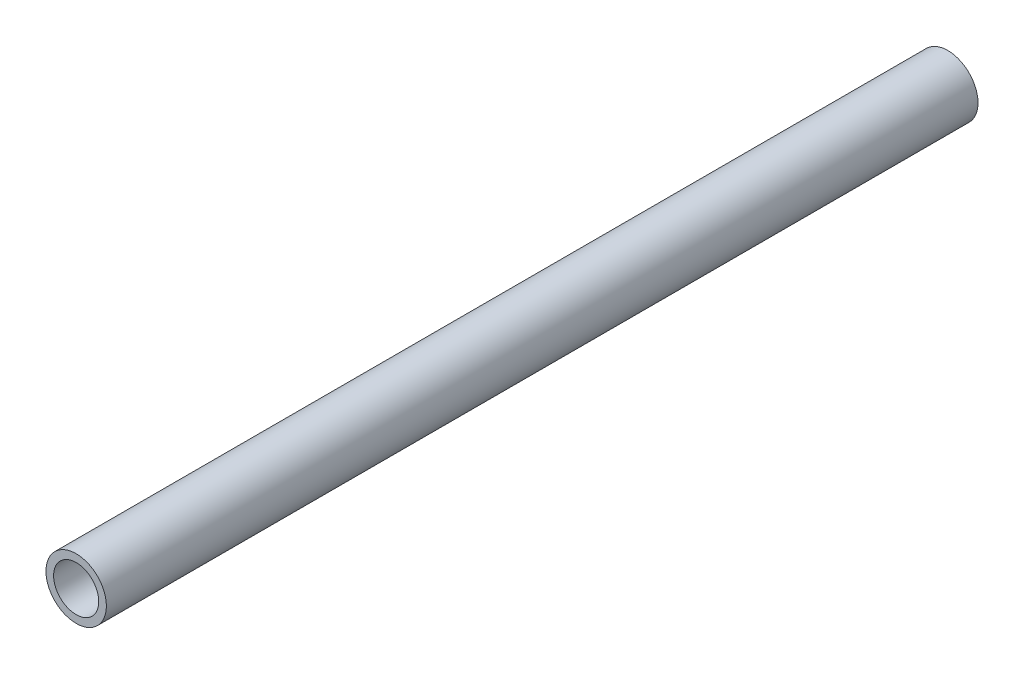
ISO-10303-21;
HEADER;
FILE_DESCRIPTION(('STEP AP214'),'2;1');
FILE_NAME('part.step','',(''),(''),'','','');
FILE_SCHEMA(('AUTOMOTIVE_DESIGN { 1 0 10303 214 1 1 1 1 }'));
ENDSEC;
DATA;
#1=APPLICATION_CONTEXT('core data for automotive mechanical design processes');
#2=APPLICATION_PROTOCOL_DEFINITION('international standard','automotive_design',2000,#1);
#3=PRODUCT_CONTEXT('',#1,'mechanical');
#4=PRODUCT('Part','Part','',(#3));
#5=PRODUCT_RELATED_PRODUCT_CATEGORY('part','',(#4));
#6=PRODUCT_DEFINITION_FORMATION('','',#4);
#7=PRODUCT_DEFINITION_CONTEXT('part definition',#1,'design');
#8=PRODUCT_DEFINITION('design','',#6,#7);
#9=PRODUCT_DEFINITION_SHAPE('','',#8);
#10=(LENGTH_UNIT() NAMED_UNIT(*) SI_UNIT(.MILLI.,.METRE.));
#11=(NAMED_UNIT(*) PLANE_ANGLE_UNIT() SI_UNIT($,.RADIAN.));
#12=(NAMED_UNIT(*) SI_UNIT($,.STERADIAN.) SOLID_ANGLE_UNIT());
#13=UNCERTAINTY_MEASURE_WITH_UNIT(LENGTH_MEASURE(1.E-05),#10,'distance_accuracy_value','');
#14=(GEOMETRIC_REPRESENTATION_CONTEXT(3) GLOBAL_UNCERTAINTY_ASSIGNED_CONTEXT((#13)) GLOBAL_UNIT_ASSIGNED_CONTEXT((#10,
#11,#12)) REPRESENTATION_CONTEXT('',''));
#15=CARTESIAN_POINT('',(0.,0.,0.));
#16=DIRECTION('',(0.,0.,1.));
#17=DIRECTION('',(1.,0.,0.));
#18=AXIS2_PLACEMENT_3D('',#15,#16,#17);
#19=CARTESIAN_POINT('',(0.,0.,61.3));
#20=DIRECTION('',(0.,0.,1.));
#21=DIRECTION('',(1.,0.,0.));
#22=AXIS2_PLACEMENT_3D('',#19,#20,#21);
#23=PLANE('',#22);
#24=CARTESIAN_POINT('',(0.,0.,61.3));
#25=DIRECTION('',(0.,0.,1.));
#26=DIRECTION('',(1.,0.,0.));
#27=AXIS2_PLACEMENT_3D('',#24,#25,#26);
#28=CIRCLE('',#27,2.125);
#29=CARTESIAN_POINT('',(2.125,0.,61.3));
#30=VERTEX_POINT('',#29);
#31=EDGE_CURVE('E10',#30,#30,#28,.T.);
#32=ORIENTED_EDGE('',*,*,#31,.T.);
#33=EDGE_LOOP('',(#32));
#34=FACE_BOUND('',#33,.T.);
#35=CARTESIAN_POINT('',(0.,0.,61.3));
#36=DIRECTION('',(0.,0.,1.));
#37=DIRECTION('',(1.,0.,0.));
#38=AXIS2_PLACEMENT_3D('',#35,#36,#37);
#39=CIRCLE('',#38,1.5875);
#40=CARTESIAN_POINT('',(1.5875,0.,61.3));
#41=VERTEX_POINT('',#40);
#42=EDGE_CURVE('E46',#41,#41,#39,.T.);
#43=ORIENTED_EDGE('',*,*,#42,.F.);
#44=EDGE_LOOP('',(#43));
#45=FACE_BOUND('',#44,.T.);
#46=ADVANCED_FACE('F35',(#34,#45),#23,.T.);
#47=CARTESIAN_POINT('',(0.,0.,0.));
#48=DIRECTION('',(0.,0.,1.));
#49=DIRECTION('',(1.,0.,0.));
#50=AXIS2_PLACEMENT_3D('',#47,#48,#49);
#51=PLANE('',#50);
#52=CARTESIAN_POINT('',(0.,0.,0.));
#53=DIRECTION('',(0.,0.,1.));
#54=DIRECTION('',(1.,0.,0.));
#55=AXIS2_PLACEMENT_3D('',#52,#53,#54);
#56=CIRCLE('',#55,2.125);
#57=CARTESIAN_POINT('',(2.125,0.,0.));
#58=VERTEX_POINT('',#57);
#59=EDGE_CURVE('E39',#58,#58,#56,.T.);
#60=ORIENTED_EDGE('',*,*,#59,.F.);
#61=EDGE_LOOP('',(#60));
#62=FACE_BOUND('',#61,.T.);
#63=CARTESIAN_POINT('',(0.,0.,0.));
#64=DIRECTION('',(0.,0.,1.));
#65=DIRECTION('',(1.,0.,0.));
#66=AXIS2_PLACEMENT_3D('',#63,#64,#65);
#67=CIRCLE('',#66,1.5875);
#68=CARTESIAN_POINT('',(1.5875,0.,0.));
#69=VERTEX_POINT('',#68);
#70=EDGE_CURVE('E48',#69,#69,#67,.T.);
#71=ORIENTED_EDGE('',*,*,#70,.T.);
#72=EDGE_LOOP('',(#71));
#73=FACE_BOUND('',#72,.T.);
#74=ADVANCED_FACE('F58',(#62,#73),#51,.F.);
#75=CARTESIAN_POINT('',(0.,0.,61.3));
#76=DIRECTION('',(0.,0.,-1.));
#77=DIRECTION('',(-1.,0.,0.));
#78=AXIS2_PLACEMENT_3D('',#75,#76,#77);
#79=CYLINDRICAL_SURFACE('',#78,2.125);
#80=ORIENTED_EDGE('',*,*,#31,.F.);
#81=EDGE_LOOP('',(#80));
#82=FACE_BOUND('',#81,.T.);
#83=ORIENTED_EDGE('',*,*,#59,.T.);
#84=EDGE_LOOP('',(#83));
#85=FACE_BOUND('',#84,.T.);
#86=ADVANCED_FACE('F37',(#82,#85),#79,.T.);
#87=CARTESIAN_POINT('',(0.,0.,61.3));
#88=DIRECTION('',(0.,0.,-1.));
#89=DIRECTION('',(-1.,0.,0.));
#90=AXIS2_PLACEMENT_3D('',#87,#88,#89);
#91=CYLINDRICAL_SURFACE('',#90,1.5875);
#92=ORIENTED_EDGE('',*,*,#42,.T.);
#93=EDGE_LOOP('',(#92));
#94=FACE_BOUND('',#93,.T.);
#95=ORIENTED_EDGE('',*,*,#70,.F.);
#96=EDGE_LOOP('',(#95));
#97=FACE_BOUND('',#96,.T.);
#98=ADVANCED_FACE('F54',(#94,#97),#91,.F.);
#99=CLOSED_SHELL('',(#46,#74,#86,#98));
#100=MANIFOLD_SOLID_BREP('B2',#99);
#101=ADVANCED_BREP_SHAPE_REPRESENTATION('',(#18,#100),#14);
#102=SHAPE_DEFINITION_REPRESENTATION(#9,#101);
ENDSEC;
END-ISO-10303-21;
